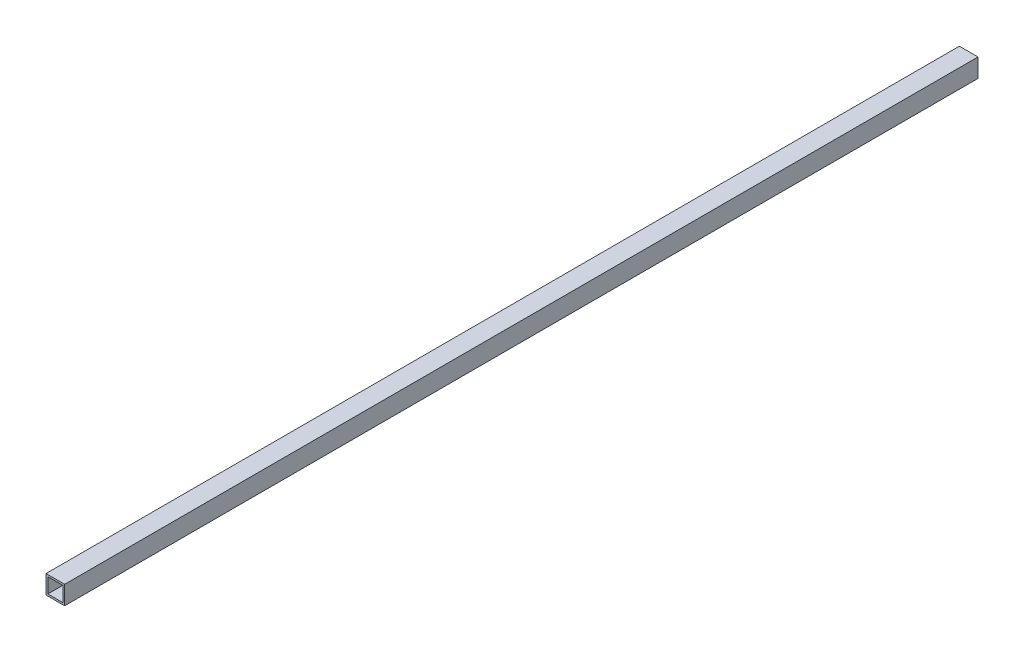
ISO-10303-21;
HEADER;
FILE_DESCRIPTION(('STEP AP214'),'2;1');
FILE_NAME('part.step','',(''),(''),'','','');
FILE_SCHEMA(('AUTOMOTIVE_DESIGN { 1 0 10303 214 1 1 1 1 }'));
ENDSEC;
DATA;
#1=APPLICATION_CONTEXT('core data for automotive mechanical design processes');
#2=APPLICATION_PROTOCOL_DEFINITION('international standard','automotive_design',2000,#1);
#3=PRODUCT_CONTEXT('',#1,'mechanical');
#4=PRODUCT('Part','Part','',(#3));
#5=PRODUCT_RELATED_PRODUCT_CATEGORY('part','',(#4));
#6=PRODUCT_DEFINITION_FORMATION('','',#4);
#7=PRODUCT_DEFINITION_CONTEXT('part definition',#1,'design');
#8=PRODUCT_DEFINITION('design','',#6,#7);
#9=PRODUCT_DEFINITION_SHAPE('','',#8);
#10=(LENGTH_UNIT() NAMED_UNIT(*) SI_UNIT(.MILLI.,.METRE.));
#11=(NAMED_UNIT(*) PLANE_ANGLE_UNIT() SI_UNIT($,.RADIAN.));
#12=(NAMED_UNIT(*) SI_UNIT($,.STERADIAN.) SOLID_ANGLE_UNIT());
#13=UNCERTAINTY_MEASURE_WITH_UNIT(LENGTH_MEASURE(1.E-05),#10,'distance_accuracy_value','');
#14=(GEOMETRIC_REPRESENTATION_CONTEXT(3) GLOBAL_UNCERTAINTY_ASSIGNED_CONTEXT((#13)) GLOBAL_UNIT_ASSIGNED_CONTEXT((#10,
#11,#12)) REPRESENTATION_CONTEXT('',''));
#15=CARTESIAN_POINT('',(0.,0.,0.));
#16=DIRECTION('',(0.,0.,1.));
#17=DIRECTION('',(1.,0.,0.));
#18=AXIS2_PLACEMENT_3D('',#15,#16,#17);
#19=CARTESIAN_POINT('',(-20.,20.,0.));
#20=DIRECTION('',(-1.,0.,0.));
#21=DIRECTION('',(0.,0.,1.));
#22=AXIS2_PLACEMENT_3D('',#19,#20,#21);
#23=PLANE('',#22);
#24=DIRECTION('',(0.,0.,1.));
#25=VECTOR('',#24,1.);
#26=CARTESIAN_POINT('',(-20.,-20.,0.));
#27=LINE('',#26,#25);
#28=CARTESIAN_POINT('',(-20.,-20.,0.));
#29=VERTEX_POINT('',#28);
#30=CARTESIAN_POINT('',(-20.,-20.,1960.));
#31=VERTEX_POINT('',#30);
#32=EDGE_CURVE('E91',#29,#31,#27,.T.);
#33=ORIENTED_EDGE('',*,*,#32,.T.);
#34=DIRECTION('',(0.,-1.,0.));
#35=VECTOR('',#34,1.);
#36=CARTESIAN_POINT('',(-20.,20.,1960.));
#37=LINE('',#36,#35);
#38=CARTESIAN_POINT('',(-20.,20.,1960.));
#39=VERTEX_POINT('',#38);
#40=EDGE_CURVE('E113',#39,#31,#37,.T.);
#41=ORIENTED_EDGE('',*,*,#40,.F.);
#42=DIRECTION('',(0.,0.,1.));
#43=VECTOR('',#42,1.);
#44=CARTESIAN_POINT('',(-20.,20.,0.));
#45=LINE('',#44,#43);
#46=CARTESIAN_POINT('',(-20.,20.,0.));
#47=VERTEX_POINT('',#46);
#48=EDGE_CURVE('E94',#47,#39,#45,.T.);
#49=ORIENTED_EDGE('',*,*,#48,.F.);
#50=DIRECTION('',(0.,-1.,0.));
#51=VECTOR('',#50,1.);
#52=CARTESIAN_POINT('',(-20.,20.,0.));
#53=LINE('',#52,#51);
#54=EDGE_CURVE('E90',#47,#29,#53,.T.);
#55=ORIENTED_EDGE('',*,*,#54,.T.);
#56=EDGE_LOOP('',(#33,#41,#49,#55));
#57=FACE_BOUND('',#56,.T.);
#58=ADVANCED_FACE('F34',(#57),#23,.T.);
#59=CARTESIAN_POINT('',(-20.,-20.,0.));
#60=DIRECTION('',(0.,-1.,0.));
#61=DIRECTION('',(0.,0.,-1.));
#62=AXIS2_PLACEMENT_3D('',#59,#60,#61);
#63=PLANE('',#62);
#64=DIRECTION('',(0.,0.,1.));
#65=VECTOR('',#64,1.);
#66=CARTESIAN_POINT('',(20.,-20.,0.));
#67=LINE('',#66,#65);
#68=CARTESIAN_POINT('',(20.,-20.,0.));
#69=VERTEX_POINT('',#68);
#70=CARTESIAN_POINT('',(20.,-20.,1960.));
#71=VERTEX_POINT('',#70);
#72=EDGE_CURVE('E101',#69,#71,#67,.T.);
#73=ORIENTED_EDGE('',*,*,#72,.T.);
#74=DIRECTION('',(1.,0.,0.));
#75=VECTOR('',#74,1.);
#76=CARTESIAN_POINT('',(-20.,-20.,1960.));
#77=LINE('',#76,#75);
#78=EDGE_CURVE('E100',#31,#71,#77,.T.);
#79=ORIENTED_EDGE('',*,*,#78,.F.);
#80=ORIENTED_EDGE('',*,*,#32,.F.);
#81=DIRECTION('',(1.,0.,0.));
#82=VECTOR('',#81,1.);
#83=CARTESIAN_POINT('',(-20.,-20.,0.));
#84=LINE('',#83,#82);
#85=EDGE_CURVE('E83',#29,#69,#84,.T.);
#86=ORIENTED_EDGE('',*,*,#85,.T.);
#87=EDGE_LOOP('',(#73,#79,#80,#86));
#88=FACE_BOUND('',#87,.T.);
#89=ADVANCED_FACE('F98',(#88),#63,.T.);
#90=CARTESIAN_POINT('',(20.,20.,0.));
#91=DIRECTION('',(1.,0.,0.));
#92=DIRECTION('',(0.,0.,-1.));
#93=AXIS2_PLACEMENT_3D('',#90,#91,#92);
#94=PLANE('',#93);
#95=DIRECTION('',(0.,0.,1.));
#96=VECTOR('',#95,1.);
#97=CARTESIAN_POINT('',(20.,20.,0.));
#98=LINE('',#97,#96);
#99=CARTESIAN_POINT('',(20.,20.,0.));
#100=VERTEX_POINT('',#99);
#101=CARTESIAN_POINT('',(20.,20.,1960.));
#102=VERTEX_POINT('',#101);
#103=EDGE_CURVE('E38',#100,#102,#98,.T.);
#104=ORIENTED_EDGE('',*,*,#103,.T.);
#105=DIRECTION('',(0.,1.,0.));
#106=VECTOR('',#105,1.);
#107=CARTESIAN_POINT('',(20.,20.,1960.));
#108=LINE('',#107,#106);
#109=EDGE_CURVE('E110',#71,#102,#108,.T.);
#110=ORIENTED_EDGE('',*,*,#109,.F.);
#111=ORIENTED_EDGE('',*,*,#72,.F.);
#112=DIRECTION('',(0.,1.,0.));
#113=VECTOR('',#112,1.);
#114=CARTESIAN_POINT('',(20.,20.,0.));
#115=LINE('',#114,#113);
#116=EDGE_CURVE('E105',#69,#100,#115,.T.);
#117=ORIENTED_EDGE('',*,*,#116,.T.);
#118=EDGE_LOOP('',(#104,#110,#111,#117));
#119=FACE_BOUND('',#118,.T.);
#120=ADVANCED_FACE('F119',(#119),#94,.T.);
#121=CARTESIAN_POINT('',(-20.,20.,0.));
#122=DIRECTION('',(0.,1.,0.));
#123=DIRECTION('',(0.,0.,1.));
#124=AXIS2_PLACEMENT_3D('',#121,#122,#123);
#125=PLANE('',#124);
#126=DIRECTION('',(-1.,0.,0.));
#127=VECTOR('',#126,1.);
#128=CARTESIAN_POINT('',(-20.,20.,1960.));
#129=LINE('',#128,#127);
#130=EDGE_CURVE('E124',#102,#39,#129,.T.);
#131=ORIENTED_EDGE('',*,*,#130,.F.);
#132=ORIENTED_EDGE('',*,*,#103,.F.);
#133=DIRECTION('',(-1.,0.,0.));
#134=VECTOR('',#133,1.);
#135=CARTESIAN_POINT('',(-20.,20.,0.));
#136=LINE('',#135,#134);
#137=EDGE_CURVE('E107',#100,#47,#136,.T.);
#138=ORIENTED_EDGE('',*,*,#137,.T.);
#139=ORIENTED_EDGE('',*,*,#48,.T.);
#140=EDGE_LOOP('',(#131,#132,#138,#139));
#141=FACE_BOUND('',#140,.T.);
#142=ADVANCED_FACE('F36',(#141),#125,.T.);
#143=CARTESIAN_POINT('',(0.,0.,0.));
#144=DIRECTION('',(0.,0.,1.));
#145=DIRECTION('',(1.,0.,0.));
#146=AXIS2_PLACEMENT_3D('',#143,#144,#145);
#147=PLANE('',#146);
#148=DIRECTION('',(0.,-1.,0.));
#149=VECTOR('',#148,1.);
#150=CARTESIAN_POINT('',(-16.,16.,0.));
#151=LINE('',#150,#149);
#152=CARTESIAN_POINT('',(-16.,-16.,0.));
#153=VERTEX_POINT('',#152);
#154=CARTESIAN_POINT('',(-16.,16.,0.));
#155=VERTEX_POINT('',#154);
#156=EDGE_CURVE('E129',#153,#155,#151,.F.);
#157=ORIENTED_EDGE('',*,*,#156,.F.);
#158=DIRECTION('',(1.,0.,0.));
#159=VECTOR('',#158,1.);
#160=CARTESIAN_POINT('',(-16.,-16.,0.));
#161=LINE('',#160,#159);
#162=CARTESIAN_POINT('',(16.,-16.,0.));
#163=VERTEX_POINT('',#162);
#164=EDGE_CURVE('E133',#163,#153,#161,.F.);
#165=ORIENTED_EDGE('',*,*,#164,.F.);
#166=DIRECTION('',(0.,1.,0.));
#167=VECTOR('',#166,1.);
#168=CARTESIAN_POINT('',(16.,16.,0.));
#169=LINE('',#168,#167);
#170=CARTESIAN_POINT('',(16.,16.,0.));
#171=VERTEX_POINT('',#170);
#172=EDGE_CURVE('E140',#171,#163,#169,.F.);
#173=ORIENTED_EDGE('',*,*,#172,.F.);
#174=DIRECTION('',(-1.,0.,0.));
#175=VECTOR('',#174,1.);
#176=CARTESIAN_POINT('',(-16.,16.,0.));
#177=LINE('',#176,#175);
#178=EDGE_CURVE('E125',#155,#171,#177,.F.);
#179=ORIENTED_EDGE('',*,*,#178,.F.);
#180=EDGE_LOOP('',(#157,#165,#173,#179));
#181=FACE_BOUND('',#180,.T.);
#182=ORIENTED_EDGE('',*,*,#54,.F.);
#183=ORIENTED_EDGE('',*,*,#137,.F.);
#184=ORIENTED_EDGE('',*,*,#116,.F.);
#185=ORIENTED_EDGE('',*,*,#85,.F.);
#186=EDGE_LOOP('',(#182,#183,#184,#185));
#187=FACE_BOUND('',#186,.T.);
#188=ADVANCED_FACE('F104',(#181,#187),#147,.F.);
#189=CARTESIAN_POINT('',(0.,0.,1960.));
#190=DIRECTION('',(0.,0.,1.));
#191=DIRECTION('',(1.,0.,0.));
#192=AXIS2_PLACEMENT_3D('',#189,#190,#191);
#193=PLANE('',#192);
#194=DIRECTION('',(0.,-1.,0.));
#195=VECTOR('',#194,1.);
#196=CARTESIAN_POINT('',(-16.,16.,1960.));
#197=LINE('',#196,#195);
#198=CARTESIAN_POINT('',(-16.,-16.,1960.));
#199=VERTEX_POINT('',#198);
#200=CARTESIAN_POINT('',(-16.,16.,1960.));
#201=VERTEX_POINT('',#200);
#202=EDGE_CURVE('E11',#199,#201,#197,.F.);
#203=ORIENTED_EDGE('',*,*,#202,.T.);
#204=DIRECTION('',(-1.,0.,0.));
#205=VECTOR('',#204,1.);
#206=CARTESIAN_POINT('',(-16.,16.,1960.));
#207=LINE('',#206,#205);
#208=CARTESIAN_POINT('',(16.,16.,1960.));
#209=VERTEX_POINT('',#208);
#210=EDGE_CURVE('E150',#201,#209,#207,.F.);
#211=ORIENTED_EDGE('',*,*,#210,.T.);
#212=DIRECTION('',(0.,1.,0.));
#213=VECTOR('',#212,1.);
#214=CARTESIAN_POINT('',(16.,16.,1960.));
#215=LINE('',#214,#213);
#216=CARTESIAN_POINT('',(16.,-16.,1960.));
#217=VERTEX_POINT('',#216);
#218=EDGE_CURVE('E143',#209,#217,#215,.F.);
#219=ORIENTED_EDGE('',*,*,#218,.T.);
#220=DIRECTION('',(1.,0.,0.));
#221=VECTOR('',#220,1.);
#222=CARTESIAN_POINT('',(-16.,-16.,1960.));
#223=LINE('',#222,#221);
#224=EDGE_CURVE('E52',#217,#199,#223,.F.);
#225=ORIENTED_EDGE('',*,*,#224,.T.);
#226=EDGE_LOOP('',(#203,#211,#219,#225));
#227=FACE_BOUND('',#226,.T.);
#228=ORIENTED_EDGE('',*,*,#40,.T.);
#229=ORIENTED_EDGE('',*,*,#78,.T.);
#230=ORIENTED_EDGE('',*,*,#109,.T.);
#231=ORIENTED_EDGE('',*,*,#130,.T.);
#232=EDGE_LOOP('',(#228,#229,#230,#231));
#233=FACE_BOUND('',#232,.T.);
#234=ADVANCED_FACE('F123',(#227,#233),#193,.T.);
#235=CARTESIAN_POINT('',(-16.,16.,0.));
#236=DIRECTION('',(0.,-1.,0.));
#237=DIRECTION('',(0.,0.,-1.));
#238=AXIS2_PLACEMENT_3D('',#235,#236,#237);
#239=PLANE('',#238);
#240=DIRECTION('',(0.,0.,1.));
#241=VECTOR('',#240,1.);
#242=CARTESIAN_POINT('',(16.,16.,0.));
#243=LINE('',#242,#241);
#244=EDGE_CURVE('E145',#171,#209,#243,.T.);
#245=ORIENTED_EDGE('',*,*,#244,.T.);
#246=ORIENTED_EDGE('',*,*,#210,.F.);
#247=DIRECTION('',(0.,0.,1.));
#248=VECTOR('',#247,1.);
#249=CARTESIAN_POINT('',(-16.,16.,0.));
#250=LINE('',#249,#248);
#251=EDGE_CURVE('E132',#155,#201,#250,.T.);
#252=ORIENTED_EDGE('',*,*,#251,.F.);
#253=ORIENTED_EDGE('',*,*,#178,.T.);
#254=EDGE_LOOP('',(#245,#246,#252,#253));
#255=FACE_BOUND('',#254,.T.);
#256=ADVANCED_FACE('F161',(#255),#239,.T.);
#257=CARTESIAN_POINT('',(16.,16.,0.));
#258=DIRECTION('',(-1.,0.,0.));
#259=DIRECTION('',(0.,0.,1.));
#260=AXIS2_PLACEMENT_3D('',#257,#258,#259);
#261=PLANE('',#260);
#262=DIRECTION('',(0.,0.,1.));
#263=VECTOR('',#262,1.);
#264=CARTESIAN_POINT('',(16.,-16.,0.));
#265=LINE('',#264,#263);
#266=EDGE_CURVE('E137',#163,#217,#265,.T.);
#267=ORIENTED_EDGE('',*,*,#266,.T.);
#268=ORIENTED_EDGE('',*,*,#218,.F.);
#269=ORIENTED_EDGE('',*,*,#244,.F.);
#270=ORIENTED_EDGE('',*,*,#172,.T.);
#271=EDGE_LOOP('',(#267,#268,#269,#270));
#272=FACE_BOUND('',#271,.T.);
#273=ADVANCED_FACE('F170',(#272),#261,.T.);
#274=CARTESIAN_POINT('',(-16.,-16.,0.));
#275=DIRECTION('',(0.,1.,0.));
#276=DIRECTION('',(0.,0.,1.));
#277=AXIS2_PLACEMENT_3D('',#274,#275,#276);
#278=PLANE('',#277);
#279=DIRECTION('',(0.,0.,1.));
#280=VECTOR('',#279,1.);
#281=CARTESIAN_POINT('',(-16.,-16.,0.));
#282=LINE('',#281,#280);
#283=EDGE_CURVE('E44',#153,#199,#282,.T.);
#284=ORIENTED_EDGE('',*,*,#283,.T.);
#285=ORIENTED_EDGE('',*,*,#224,.F.);
#286=ORIENTED_EDGE('',*,*,#266,.F.);
#287=ORIENTED_EDGE('',*,*,#164,.T.);
#288=EDGE_LOOP('',(#284,#285,#286,#287));
#289=FACE_BOUND('',#288,.T.);
#290=ADVANCED_FACE('F175',(#289),#278,.T.);
#291=CARTESIAN_POINT('',(-16.,16.,0.));
#292=DIRECTION('',(1.,0.,0.));
#293=DIRECTION('',(0.,0.,-1.));
#294=AXIS2_PLACEMENT_3D('',#291,#292,#293);
#295=PLANE('',#294);
#296=ORIENTED_EDGE('',*,*,#202,.F.);
#297=ORIENTED_EDGE('',*,*,#283,.F.);
#298=ORIENTED_EDGE('',*,*,#156,.T.);
#299=ORIENTED_EDGE('',*,*,#251,.T.);
#300=EDGE_LOOP('',(#296,#297,#298,#299));
#301=FACE_BOUND('',#300,.T.);
#302=ADVANCED_FACE('F179',(#301),#295,.T.);
#303=CLOSED_SHELL('',(#58,#89,#120,#142,#188,#234,#256,#273,#290,#302));
#304=MANIFOLD_SOLID_BREP('B2',#303);
#305=ADVANCED_BREP_SHAPE_REPRESENTATION('',(#18,#304),#14);
#306=SHAPE_DEFINITION_REPRESENTATION(#9,#305);
ENDSEC;
END-ISO-10303-21;
